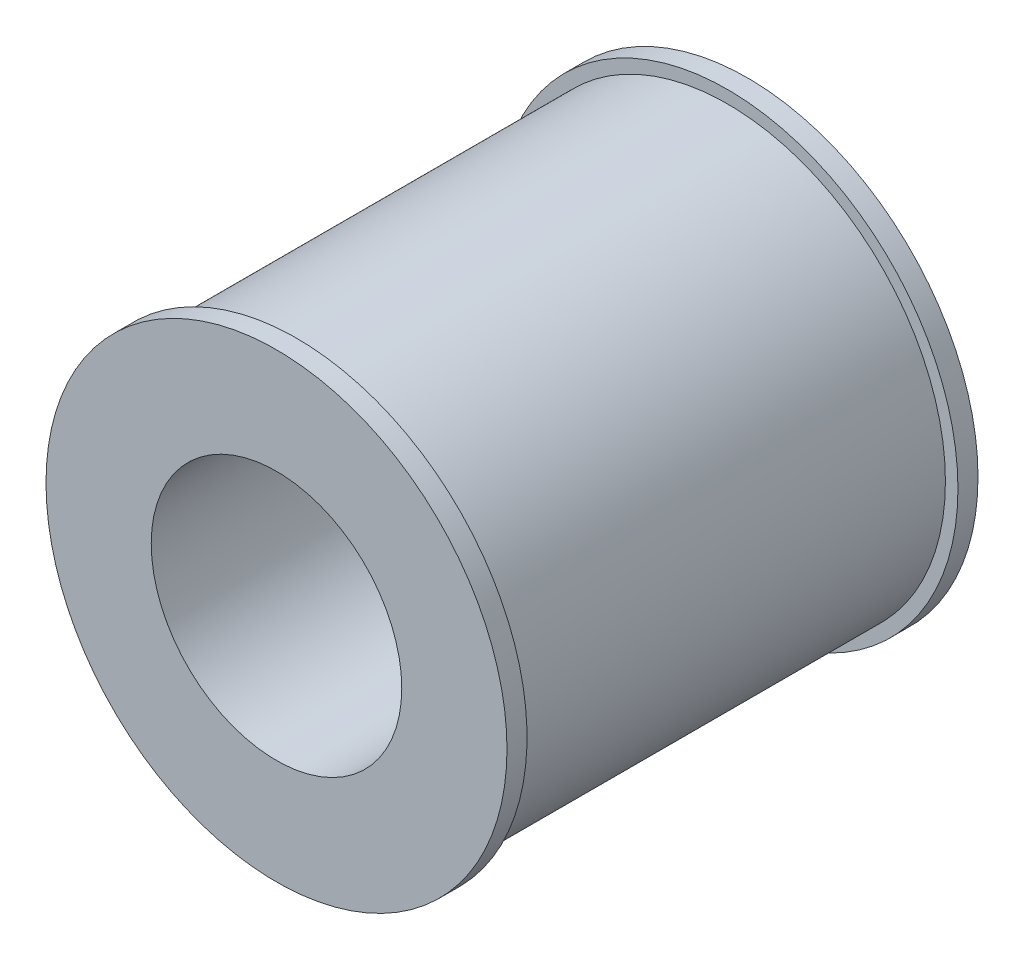
ISO-10303-21;
HEADER;
FILE_DESCRIPTION(('STEP AP214'),'2;1');
FILE_NAME('part.step','',(''),(''),'','','');
FILE_SCHEMA(('AUTOMOTIVE_DESIGN { 1 0 10303 214 1 1 1 1 }'));
ENDSEC;
DATA;
#1=APPLICATION_CONTEXT('core data for automotive mechanical design processes');
#2=APPLICATION_PROTOCOL_DEFINITION('international standard','automotive_design',2000,#1);
#3=PRODUCT_CONTEXT('',#1,'mechanical');
#4=PRODUCT('Part','Part','',(#3));
#5=PRODUCT_RELATED_PRODUCT_CATEGORY('part','',(#4));
#6=PRODUCT_DEFINITION_FORMATION('','',#4);
#7=PRODUCT_DEFINITION_CONTEXT('part definition',#1,'design');
#8=PRODUCT_DEFINITION('design','',#6,#7);
#9=PRODUCT_DEFINITION_SHAPE('','',#8);
#10=(LENGTH_UNIT() NAMED_UNIT(*) SI_UNIT(.MILLI.,.METRE.));
#11=(NAMED_UNIT(*) PLANE_ANGLE_UNIT() SI_UNIT($,.RADIAN.));
#12=(NAMED_UNIT(*) SI_UNIT($,.STERADIAN.) SOLID_ANGLE_UNIT());
#13=UNCERTAINTY_MEASURE_WITH_UNIT(LENGTH_MEASURE(1.E-05),#10,'distance_accuracy_value','');
#14=(GEOMETRIC_REPRESENTATION_CONTEXT(3) GLOBAL_UNCERTAINTY_ASSIGNED_CONTEXT((#13)) GLOBAL_UNIT_ASSIGNED_CONTEXT((#10,
#11,#12)) REPRESENTATION_CONTEXT('',''));
#15=CARTESIAN_POINT('',(0.,0.,0.));
#16=DIRECTION('',(0.,0.,1.));
#17=DIRECTION('',(1.,0.,0.));
#18=AXIS2_PLACEMENT_3D('',#15,#16,#17);
#19=CARTESIAN_POINT('',(0.,0.,47.));
#20=DIRECTION('',(0.,0.,-1.));
#21=DIRECTION('',(-1.,0.,0.));
#22=AXIS2_PLACEMENT_3D('',#19,#20,#21);
#23=CYLINDRICAL_SURFACE('',#22,23.);
#24=CARTESIAN_POINT('',(0.,0.,0.));
#25=DIRECTION('',(0.,0.,1.));
#26=DIRECTION('',(1.,0.,0.));
#27=AXIS2_PLACEMENT_3D('',#24,#25,#26);
#28=CIRCLE('',#27,23.);
#29=CARTESIAN_POINT('',(23.,0.,0.));
#30=VERTEX_POINT('',#29);
#31=EDGE_CURVE('E41',#30,#30,#28,.T.);
#32=ORIENTED_EDGE('',*,*,#31,.T.);
#33=EDGE_LOOP('',(#32));
#34=FACE_BOUND('',#33,.T.);
#35=CARTESIAN_POINT('',(0.,0.,2.));
#36=DIRECTION('',(0.,0.,1.));
#37=DIRECTION('',(1.,0.,0.));
#38=AXIS2_PLACEMENT_3D('',#35,#36,#37);
#39=CIRCLE('',#38,23.);
#40=CARTESIAN_POINT('',(23.,0.,2.));
#41=VERTEX_POINT('',#40);
#42=EDGE_CURVE('E37',#41,#41,#39,.T.);
#43=ORIENTED_EDGE('',*,*,#42,.F.);
#44=EDGE_LOOP('',(#43));
#45=FACE_BOUND('',#44,.T.);
#46=ADVANCED_FACE('F34',(#34,#45),#23,.T.);
#47=CARTESIAN_POINT('',(0.,0.,47.));
#48=DIRECTION('',(0.,0.,1.));
#49=DIRECTION('',(1.,0.,0.));
#50=AXIS2_PLACEMENT_3D('',#47,#48,#49);
#51=CIRCLE('',#50,23.);
#52=CARTESIAN_POINT('',(23.,0.,47.));
#53=VERTEX_POINT('',#52);
#54=EDGE_CURVE('E10',#53,#53,#51,.T.);
#55=ORIENTED_EDGE('',*,*,#54,.F.);
#56=EDGE_LOOP('',(#55));
#57=FACE_BOUND('',#56,.T.);
#58=CARTESIAN_POINT('',(0.,0.,45.));
#59=DIRECTION('',(0.,0.,-1.));
#60=DIRECTION('',(-1.,0.,0.));
#61=AXIS2_PLACEMENT_3D('',#58,#59,#60);
#62=CIRCLE('',#61,23.);
#63=CARTESIAN_POINT('',(-23.,0.,45.));
#64=VERTEX_POINT('',#63);
#65=EDGE_CURVE('E51',#64,#64,#62,.T.);
#66=ORIENTED_EDGE('',*,*,#65,.F.);
#67=EDGE_LOOP('',(#66));
#68=FACE_BOUND('',#67,.T.);
#69=ADVANCED_FACE('F87',(#57,#68),#23,.T.);
#70=CARTESIAN_POINT('',(0.,0.,47.));
#71=DIRECTION('',(0.,0.,1.));
#72=DIRECTION('',(1.,0.,0.));
#73=AXIS2_PLACEMENT_3D('',#70,#71,#72);
#74=PLANE('',#73);
#75=ORIENTED_EDGE('',*,*,#54,.T.);
#76=EDGE_LOOP('',(#75));
#77=FACE_BOUND('',#76,.T.);
#78=CARTESIAN_POINT('',(0.,0.,47.));
#79=DIRECTION('',(0.,0.,1.));
#80=DIRECTION('',(1.,0.,0.));
#81=AXIS2_PLACEMENT_3D('',#78,#79,#80);
#82=CIRCLE('',#81,12.5);
#83=CARTESIAN_POINT('',(12.5,0.,47.));
#84=VERTEX_POINT('',#83);
#85=EDGE_CURVE('E46',#84,#84,#82,.T.);
#86=ORIENTED_EDGE('',*,*,#85,.F.);
#87=EDGE_LOOP('',(#86));
#88=FACE_BOUND('',#87,.T.);
#89=ADVANCED_FACE('F83',(#77,#88),#74,.T.);
#90=CARTESIAN_POINT('',(0.,0.,0.));
#91=DIRECTION('',(0.,0.,1.));
#92=DIRECTION('',(1.,0.,0.));
#93=AXIS2_PLACEMENT_3D('',#90,#91,#92);
#94=PLANE('',#93);
#95=ORIENTED_EDGE('',*,*,#31,.F.);
#96=EDGE_LOOP('',(#95));
#97=FACE_BOUND('',#96,.T.);
#98=CARTESIAN_POINT('',(0.,0.,0.));
#99=DIRECTION('',(0.,0.,1.));
#100=DIRECTION('',(1.,0.,0.));
#101=AXIS2_PLACEMENT_3D('',#98,#99,#100);
#102=CIRCLE('',#101,12.5);
#103=CARTESIAN_POINT('',(12.5,0.,0.));
#104=VERTEX_POINT('',#103);
#105=EDGE_CURVE('E49',#104,#104,#102,.T.);
#106=ORIENTED_EDGE('',*,*,#105,.T.);
#107=EDGE_LOOP('',(#106));
#108=FACE_BOUND('',#107,.T.);
#109=ADVANCED_FACE('F70',(#97,#108),#94,.F.);
#110=CARTESIAN_POINT('',(0.,0.,47.));
#111=DIRECTION('',(0.,0.,-1.));
#112=DIRECTION('',(-1.,0.,0.));
#113=AXIS2_PLACEMENT_3D('',#110,#111,#112);
#114=CYLINDRICAL_SURFACE('',#113,12.5);
#115=ORIENTED_EDGE('',*,*,#85,.T.);
#116=EDGE_LOOP('',(#115));
#117=FACE_BOUND('',#116,.T.);
#118=ORIENTED_EDGE('',*,*,#105,.F.);
#119=EDGE_LOOP('',(#118));
#120=FACE_BOUND('',#119,.T.);
#121=ADVANCED_FACE('F72',(#117,#120),#114,.F.);
#122=CARTESIAN_POINT('',(0.,21.7500000000001,2.));
#123=DIRECTION('',(0.,0.,1.));
#124=DIRECTION('',(1.,0.,0.));
#125=AXIS2_PLACEMENT_3D('',#122,#123,#124);
#126=PLANE('',#125);
#127=CARTESIAN_POINT('',(0.,0.,2.));
#128=DIRECTION('',(0.,0.,1.));
#129=DIRECTION('',(1.,0.,0.));
#130=AXIS2_PLACEMENT_3D('',#127,#128,#129);
#131=CIRCLE('',#130,21.75);
#132=CARTESIAN_POINT('',(21.75,0.,2.));
#133=VERTEX_POINT('',#132);
#134=EDGE_CURVE('E53',#133,#133,#131,.T.);
#135=ORIENTED_EDGE('',*,*,#134,.F.);
#136=EDGE_LOOP('',(#135));
#137=FACE_BOUND('',#136,.T.);
#138=ORIENTED_EDGE('',*,*,#42,.T.);
#139=EDGE_LOOP('',(#138));
#140=FACE_BOUND('',#139,.T.);
#141=ADVANCED_FACE('F74',(#137,#140),#126,.T.);
#142=CARTESIAN_POINT('',(0.,21.7500000000001,45.));
#143=DIRECTION('',(0.,0.,-1.));
#144=DIRECTION('',(-1.,0.,0.));
#145=AXIS2_PLACEMENT_3D('',#142,#143,#144);
#146=PLANE('',#145);
#147=CARTESIAN_POINT('',(0.,0.,45.));
#148=DIRECTION('',(0.,0.,1.));
#149=DIRECTION('',(1.,0.,0.));
#150=AXIS2_PLACEMENT_3D('',#147,#148,#149);
#151=CIRCLE('',#150,21.75);
#152=CARTESIAN_POINT('',(21.75,0.,45.));
#153=VERTEX_POINT('',#152);
#154=EDGE_CURVE('E58',#153,#153,#151,.T.);
#155=ORIENTED_EDGE('',*,*,#154,.T.);
#156=EDGE_LOOP('',(#155));
#157=FACE_BOUND('',#156,.T.);
#158=ORIENTED_EDGE('',*,*,#65,.T.);
#159=EDGE_LOOP('',(#158));
#160=FACE_BOUND('',#159,.T.);
#161=ADVANCED_FACE('F80',(#157,#160),#146,.T.);
#162=CARTESIAN_POINT('',(0.,0.,47.));
#163=DIRECTION('',(0.,0.,1.));
#164=DIRECTION('',(1.,0.,0.));
#165=AXIS2_PLACEMENT_3D('',#162,#163,#164);
#166=CYLINDRICAL_SURFACE('',#165,21.75);
#167=ORIENTED_EDGE('',*,*,#134,.T.);
#168=EDGE_LOOP('',(#167));
#169=FACE_BOUND('',#168,.T.);
#170=ORIENTED_EDGE('',*,*,#154,.F.);
#171=EDGE_LOOP('',(#170));
#172=FACE_BOUND('',#171,.T.);
#173=ADVANCED_FACE('F125',(#169,#172),#166,.T.);
#174=CLOSED_SHELL('',(#46,#69,#89,#109,#121,#141,#161,#173));
#175=MANIFOLD_SOLID_BREP('B2',#174);
#176=ADVANCED_BREP_SHAPE_REPRESENTATION('',(#18,#175),#14);
#177=SHAPE_DEFINITION_REPRESENTATION(#9,#176);
ENDSEC;
END-ISO-10303-21;
